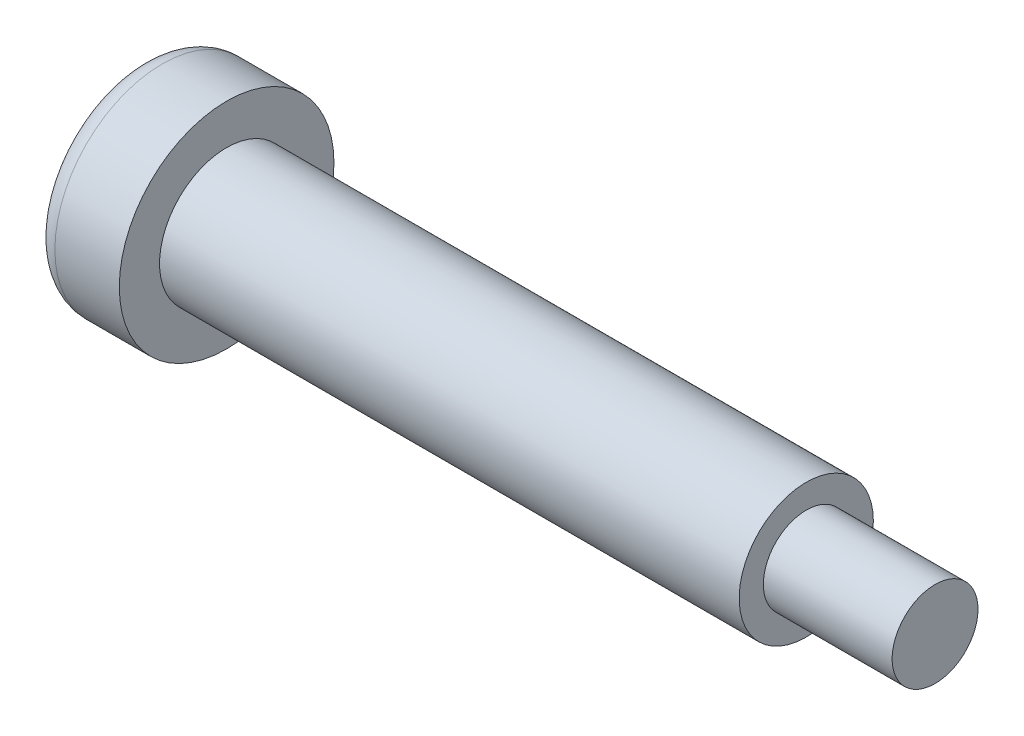
ISO-10303-21;
HEADER;
FILE_DESCRIPTION(('STEP AP214'),'2;1');
FILE_NAME('part.step','',(''),(''),'','','');
FILE_SCHEMA(('AUTOMOTIVE_DESIGN { 1 0 10303 214 1 1 1 1 }'));
ENDSEC;
DATA;
#1=APPLICATION_CONTEXT('core data for automotive mechanical design processes');
#2=APPLICATION_PROTOCOL_DEFINITION('international standard','automotive_design',2000,#1);
#3=PRODUCT_CONTEXT('',#1,'mechanical');
#4=PRODUCT('Part','Part','',(#3));
#5=PRODUCT_RELATED_PRODUCT_CATEGORY('part','',(#4));
#6=PRODUCT_DEFINITION_FORMATION('','',#4);
#7=PRODUCT_DEFINITION_CONTEXT('part definition',#1,'design');
#8=PRODUCT_DEFINITION('design','',#6,#7);
#9=PRODUCT_DEFINITION_SHAPE('','',#8);
#10=(LENGTH_UNIT() NAMED_UNIT(*) SI_UNIT(.MILLI.,.METRE.));
#11=(NAMED_UNIT(*) PLANE_ANGLE_UNIT() SI_UNIT($,.RADIAN.));
#12=(NAMED_UNIT(*) SI_UNIT($,.STERADIAN.) SOLID_ANGLE_UNIT());
#13=UNCERTAINTY_MEASURE_WITH_UNIT(LENGTH_MEASURE(1.E-05),#10,'distance_accuracy_value','');
#14=(GEOMETRIC_REPRESENTATION_CONTEXT(3) GLOBAL_UNCERTAINTY_ASSIGNED_CONTEXT((#13)) GLOBAL_UNIT_ASSIGNED_CONTEXT((#10,
#11,#12)) REPRESENTATION_CONTEXT('',''));
#15=CARTESIAN_POINT('',(0.,0.,0.));
#16=DIRECTION('',(0.,0.,1.));
#17=DIRECTION('',(1.,0.,0.));
#18=AXIS2_PLACEMENT_3D('',#15,#16,#17);
#19=CARTESIAN_POINT('',(37.,0.,0.));
#20=DIRECTION('',(-1.,0.,0.));
#21=DIRECTION('',(0.,0.,1.));
#22=AXIS2_PLACEMENT_3D('',#19,#20,#21);
#23=CYLINDRICAL_SURFACE('',#22,3.125);
#24=CARTESIAN_POINT('',(4.,0.,0.));
#25=DIRECTION('',(1.,0.,0.));
#26=DIRECTION('',(0.,0.,-1.));
#27=AXIS2_PLACEMENT_3D('',#24,#25,#26);
#28=CIRCLE('',#27,3.125);
#29=CARTESIAN_POINT('',(4.,0.,-3.125));
#30=VERTEX_POINT('',#29);
#31=EDGE_CURVE('E11',#30,#30,#28,.T.);
#32=ORIENTED_EDGE('',*,*,#31,.T.);
#33=EDGE_LOOP('',(#32));
#34=FACE_BOUND('',#33,.T.);
#35=CARTESIAN_POINT('',(31.,0.,0.));
#36=DIRECTION('',(1.,0.,0.));
#37=DIRECTION('',(0.,0.,-1.));
#38=AXIS2_PLACEMENT_3D('',#35,#36,#37);
#39=CIRCLE('',#38,3.125);
#40=CARTESIAN_POINT('',(31.,0.,-3.125));
#41=VERTEX_POINT('',#40);
#42=EDGE_CURVE('E141',#41,#41,#39,.T.);
#43=ORIENTED_EDGE('',*,*,#42,.F.);
#44=EDGE_LOOP('',(#43));
#45=FACE_BOUND('',#44,.T.);
#46=ADVANCED_FACE('F43',(#34,#45),#23,.T.);
#47=CARTESIAN_POINT('',(4.,0.,0.));
#48=DIRECTION('',(-1.,0.,0.));
#49=DIRECTION('',(0.,0.,1.));
#50=AXIS2_PLACEMENT_3D('',#47,#48,#49);
#51=CYLINDRICAL_SURFACE('',#50,5.);
#52=CARTESIAN_POINT('',(1.,0.,0.));
#53=DIRECTION('',(1.,0.,0.));
#54=DIRECTION('',(0.,0.,-1.));
#55=AXIS2_PLACEMENT_3D('',#52,#53,#54);
#56=CIRCLE('',#55,5.);
#57=CARTESIAN_POINT('',(1.,0.,-5.));
#58=VERTEX_POINT('',#57);
#59=EDGE_CURVE('E172',#58,#58,#56,.T.);
#60=ORIENTED_EDGE('',*,*,#59,.T.);
#61=EDGE_LOOP('',(#60));
#62=FACE_BOUND('',#61,.T.);
#63=CARTESIAN_POINT('',(4.,0.,0.));
#64=DIRECTION('',(1.,0.,0.));
#65=DIRECTION('',(0.,0.,-1.));
#66=AXIS2_PLACEMENT_3D('',#63,#64,#65);
#67=CIRCLE('',#66,5.);
#68=CARTESIAN_POINT('',(4.,0.,-5.));
#69=VERTEX_POINT('',#68);
#70=EDGE_CURVE('E160',#69,#69,#67,.T.);
#71=ORIENTED_EDGE('',*,*,#70,.F.);
#72=EDGE_LOOP('',(#71));
#73=FACE_BOUND('',#72,.T.);
#74=ADVANCED_FACE('F196',(#62,#73),#51,.T.);
#75=CARTESIAN_POINT('',(4.,0.,0.));
#76=DIRECTION('',(1.,0.,0.));
#77=DIRECTION('',(0.,0.,-1.));
#78=AXIS2_PLACEMENT_3D('',#75,#76,#77);
#79=PLANE('',#78);
#80=ORIENTED_EDGE('',*,*,#31,.F.);
#81=EDGE_LOOP('',(#80));
#82=FACE_BOUND('',#81,.T.);
#83=ORIENTED_EDGE('',*,*,#70,.T.);
#84=EDGE_LOOP('',(#83));
#85=FACE_BOUND('',#84,.T.);
#86=ADVANCED_FACE('F192',(#82,#85),#79,.T.);
#87=CARTESIAN_POINT('',(0.,0.,0.));
#88=DIRECTION('',(1.,0.,0.));
#89=DIRECTION('',(0.,0.,-1.));
#90=AXIS2_PLACEMENT_3D('',#87,#88,#89);
#91=PLANE('',#90);
#92=DIRECTION('',(0.,0.559454654253583,-0.828860959289315));
#93=VECTOR('',#92,1.);
#94=CARTESIAN_POINT('',(0.,1.01171932811324,2.07599550444008));
#95=LINE('',#94,#93);
#96=CARTESIAN_POINT('',(0.,1.01171932811324,2.07599550444008));
#97=VERTEX_POINT('',#96);
#98=CARTESIAN_POINT('',(0.,2.30372450904402,0.161823112574251));
#99=VERTEX_POINT('',#98);
#100=EDGE_CURVE('E140',#97,#99,#95,.T.);
#101=ORIENTED_EDGE('',*,*,#100,.F.);
#102=DIRECTION('',(0.,0.997541974076478,0.070071463204385));
#103=VECTOR('',#102,1.);
#104=CARTESIAN_POINT('',(0.,-1.29200518093078,1.91417239186583));
#105=LINE('',#104,#103);
#106=CARTESIAN_POINT('',(0.,-1.29200518093078,1.91417239186583));
#107=VERTEX_POINT('',#106);
#108=EDGE_CURVE('E60',#107,#97,#105,.T.);
#109=ORIENTED_EDGE('',*,*,#108,.F.);
#110=DIRECTION('',(0.,0.438087319822895,0.8989324224937));
#111=VECTOR('',#110,1.);
#112=CARTESIAN_POINT('',(0.,-2.30372450904402,-0.161823112574251));
#113=LINE('',#112,#111);
#114=CARTESIAN_POINT('',(0.,-2.30372450904402,-0.161823112574251));
#115=VERTEX_POINT('',#114);
#116=EDGE_CURVE('E154',#115,#107,#113,.T.);
#117=ORIENTED_EDGE('',*,*,#116,.F.);
#118=DIRECTION('',(0.,-0.559454654253583,0.828860959289315));
#119=VECTOR('',#118,1.);
#120=CARTESIAN_POINT('',(0.,-1.01171932811324,-2.07599550444008));
#121=LINE('',#120,#119);
#122=CARTESIAN_POINT('',(0.,-1.01171932811324,-2.07599550444008));
#123=VERTEX_POINT('',#122);
#124=EDGE_CURVE('E151',#123,#115,#121,.T.);
#125=ORIENTED_EDGE('',*,*,#124,.F.);
#126=DIRECTION('',(0.,-0.997541974076478,-0.0700714632043852));
#127=VECTOR('',#126,1.);
#128=CARTESIAN_POINT('',(0.,1.29200518093078,-1.91417239186583));
#129=LINE('',#128,#127);
#130=CARTESIAN_POINT('',(0.,1.29200518093078,-1.91417239186583));
#131=VERTEX_POINT('',#130);
#132=EDGE_CURVE('E108',#131,#123,#129,.T.);
#133=ORIENTED_EDGE('',*,*,#132,.F.);
#134=DIRECTION('',(0.,-0.438087319822895,-0.8989324224937));
#135=VECTOR('',#134,1.);
#136=CARTESIAN_POINT('',(0.,2.30372450904402,0.161823112574251));
#137=LINE('',#136,#135);
#138=EDGE_CURVE('E145',#99,#131,#137,.T.);
#139=ORIENTED_EDGE('',*,*,#138,.F.);
#140=EDGE_LOOP('',(#101,#109,#117,#125,#133,#139));
#141=FACE_BOUND('',#140,.T.);
#142=CARTESIAN_POINT('',(0.,0.,0.));
#143=DIRECTION('',(1.,0.,0.));
#144=DIRECTION('',(0.,0.,-1.));
#145=AXIS2_PLACEMENT_3D('',#142,#143,#144);
#146=CIRCLE('',#145,4.);
#147=CARTESIAN_POINT('',(0.,0.,-4.));
#148=VERTEX_POINT('',#147);
#149=EDGE_CURVE('E47',#148,#148,#146,.F.);
#150=ORIENTED_EDGE('',*,*,#149,.T.);
#151=EDGE_LOOP('',(#150));
#152=FACE_BOUND('',#151,.T.);
#153=ADVANCED_FACE('F181',(#141,#152),#91,.F.);
#154=CARTESIAN_POINT('',(1.,0.,0.));
#155=DIRECTION('',(1.,0.,0.));
#156=DIRECTION('',(0.,0.,-1.));
#157=AXIS2_PLACEMENT_3D('',#154,#155,#156);
#158=TOROIDAL_SURFACE('',#157,4.,1.);
#159=ORIENTED_EDGE('',*,*,#149,.F.);
#160=EDGE_LOOP('',(#159));
#161=FACE_BOUND('',#160,.T.);
#162=ORIENTED_EDGE('',*,*,#59,.F.);
#163=EDGE_LOOP('',(#162));
#164=FACE_BOUND('',#163,.T.);
#165=ADVANCED_FACE('F45',(#161,#164),#158,.T.);
#166=CARTESIAN_POINT('',(2.5,-1.29200518093078,1.91417239186583));
#167=DIRECTION('',(0.,-0.070071463204385,0.997541974076478));
#168=DIRECTION('',(0.,-0.997541974076478,-0.070071463204385));
#169=AXIS2_PLACEMENT_3D('',#166,#167,#168);
#170=PLANE('',#169);
#171=ORIENTED_EDGE('',*,*,#108,.T.);
#172=DIRECTION('',(-1.,0.,0.));
#173=VECTOR('',#172,1.);
#174=CARTESIAN_POINT('',(2.5,1.01171932811324,2.07599550444008));
#175=LINE('',#174,#173);
#176=CARTESIAN_POINT('',(2.5,1.01171932811324,2.07599550444008));
#177=VERTEX_POINT('',#176);
#178=EDGE_CURVE('E90',#177,#97,#175,.T.);
#179=ORIENTED_EDGE('',*,*,#178,.F.);
#180=DIRECTION('',(0.,0.997541974076478,0.070071463204385));
#181=VECTOR('',#180,1.);
#182=CARTESIAN_POINT('',(2.5,-1.29200518093078,1.91417239186583));
#183=LINE('',#182,#181);
#184=CARTESIAN_POINT('',(2.5,-1.29200518093078,1.91417239186583));
#185=VERTEX_POINT('',#184);
#186=EDGE_CURVE('E157',#185,#177,#183,.T.);
#187=ORIENTED_EDGE('',*,*,#186,.F.);
#188=DIRECTION('',(-1.,0.,0.));
#189=VECTOR('',#188,1.);
#190=CARTESIAN_POINT('',(2.5,-1.29200518093078,1.91417239186583));
#191=LINE('',#190,#189);
#192=EDGE_CURVE('E68',#185,#107,#191,.T.);
#193=ORIENTED_EDGE('',*,*,#192,.T.);
#194=EDGE_LOOP('',(#171,#179,#187,#193));
#195=FACE_BOUND('',#194,.T.);
#196=ADVANCED_FACE('F185',(#195),#170,.F.);
#197=CARTESIAN_POINT('',(2.5,-2.30372450904402,-0.161823112574251));
#198=DIRECTION('',(0.,-0.8989324224937,0.438087319822895));
#199=DIRECTION('',(0.,-0.438087319822895,-0.8989324224937));
#200=AXIS2_PLACEMENT_3D('',#197,#198,#199);
#201=PLANE('',#200);
#202=ORIENTED_EDGE('',*,*,#116,.T.);
#203=ORIENTED_EDGE('',*,*,#192,.F.);
#204=DIRECTION('',(0.,0.438087319822895,0.8989324224937));
#205=VECTOR('',#204,1.);
#206=CARTESIAN_POINT('',(2.5,-2.30372450904402,-0.161823112574251));
#207=LINE('',#206,#205);
#208=CARTESIAN_POINT('',(2.5,-2.30372450904402,-0.161823112574251));
#209=VERTEX_POINT('',#208);
#210=EDGE_CURVE('E122',#209,#185,#207,.T.);
#211=ORIENTED_EDGE('',*,*,#210,.F.);
#212=DIRECTION('',(-1.,0.,0.));
#213=VECTOR('',#212,1.);
#214=CARTESIAN_POINT('',(2.5,-2.30372450904402,-0.161823112574251));
#215=LINE('',#214,#213);
#216=EDGE_CURVE('E113',#209,#115,#215,.T.);
#217=ORIENTED_EDGE('',*,*,#216,.T.);
#218=EDGE_LOOP('',(#202,#203,#211,#217));
#219=FACE_BOUND('',#218,.T.);
#220=ADVANCED_FACE('F190',(#219),#201,.F.);
#221=CARTESIAN_POINT('',(2.5,-1.01171932811324,-2.07599550444008));
#222=DIRECTION('',(0.,-0.828860959289315,-0.559454654253583));
#223=DIRECTION('',(0.,0.559454654253583,-0.828860959289315));
#224=AXIS2_PLACEMENT_3D('',#221,#222,#223);
#225=PLANE('',#224);
#226=ORIENTED_EDGE('',*,*,#124,.T.);
#227=ORIENTED_EDGE('',*,*,#216,.F.);
#228=DIRECTION('',(0.,-0.559454654253583,0.828860959289315));
#229=VECTOR('',#228,1.);
#230=CARTESIAN_POINT('',(2.5,-1.01171932811324,-2.07599550444008));
#231=LINE('',#230,#229);
#232=CARTESIAN_POINT('',(2.5,-1.01171932811324,-2.07599550444008));
#233=VERTEX_POINT('',#232);
#234=EDGE_CURVE('E117',#233,#209,#231,.T.);
#235=ORIENTED_EDGE('',*,*,#234,.F.);
#236=DIRECTION('',(-1.,0.,0.));
#237=VECTOR('',#236,1.);
#238=CARTESIAN_POINT('',(2.5,-1.01171932811324,-2.07599550444008));
#239=LINE('',#238,#237);
#240=EDGE_CURVE('E101',#233,#123,#239,.T.);
#241=ORIENTED_EDGE('',*,*,#240,.T.);
#242=EDGE_LOOP('',(#226,#227,#235,#241));
#243=FACE_BOUND('',#242,.T.);
#244=ADVANCED_FACE('F118',(#243),#225,.F.);
#245=CARTESIAN_POINT('',(2.5,1.29200518093078,-1.91417239186583));
#246=DIRECTION('',(0.,0.0700714632043852,-0.997541974076478));
#247=DIRECTION('',(0.,0.997541974076478,0.0700714632043852));
#248=AXIS2_PLACEMENT_3D('',#245,#246,#247);
#249=PLANE('',#248);
#250=ORIENTED_EDGE('',*,*,#132,.T.);
#251=ORIENTED_EDGE('',*,*,#240,.F.);
#252=DIRECTION('',(0.,-0.997541974076478,-0.0700714632043852));
#253=VECTOR('',#252,1.);
#254=CARTESIAN_POINT('',(2.5,1.29200518093078,-1.91417239186583));
#255=LINE('',#254,#253);
#256=CARTESIAN_POINT('',(2.5,1.29200518093078,-1.91417239186583));
#257=VERTEX_POINT('',#256);
#258=EDGE_CURVE('E105',#257,#233,#255,.T.);
#259=ORIENTED_EDGE('',*,*,#258,.F.);
#260=DIRECTION('',(-1.,0.,0.));
#261=VECTOR('',#260,1.);
#262=CARTESIAN_POINT('',(2.5,1.29200518093078,-1.91417239186583));
#263=LINE('',#262,#261);
#264=EDGE_CURVE('E114',#257,#131,#263,.T.);
#265=ORIENTED_EDGE('',*,*,#264,.T.);
#266=EDGE_LOOP('',(#250,#251,#259,#265));
#267=FACE_BOUND('',#266,.T.);
#268=ADVANCED_FACE('F103',(#267),#249,.F.);
#269=CARTESIAN_POINT('',(2.5,2.30372450904402,0.161823112574251));
#270=DIRECTION('',(0.,0.8989324224937,-0.438087319822895));
#271=DIRECTION('',(0.,0.438087319822895,0.8989324224937));
#272=AXIS2_PLACEMENT_3D('',#269,#270,#271);
#273=PLANE('',#272);
#274=ORIENTED_EDGE('',*,*,#138,.T.);
#275=ORIENTED_EDGE('',*,*,#264,.F.);
#276=DIRECTION('',(0.,-0.438087319822895,-0.8989324224937));
#277=VECTOR('',#276,1.);
#278=CARTESIAN_POINT('',(2.5,2.30372450904402,0.161823112574251));
#279=LINE('',#278,#277);
#280=CARTESIAN_POINT('',(2.5,2.30372450904402,0.161823112574251));
#281=VERTEX_POINT('',#280);
#282=EDGE_CURVE('E128',#281,#257,#279,.T.);
#283=ORIENTED_EDGE('',*,*,#282,.F.);
#284=DIRECTION('',(-1.,0.,0.));
#285=VECTOR('',#284,1.);
#286=CARTESIAN_POINT('',(2.5,2.30372450904402,0.161823112574251));
#287=LINE('',#286,#285);
#288=EDGE_CURVE('E165',#281,#99,#287,.T.);
#289=ORIENTED_EDGE('',*,*,#288,.T.);
#290=EDGE_LOOP('',(#274,#275,#283,#289));
#291=FACE_BOUND('',#290,.T.);
#292=ADVANCED_FACE('F218',(#291),#273,.F.);
#293=CARTESIAN_POINT('',(2.5,1.01171932811324,2.07599550444008));
#294=DIRECTION('',(0.,0.828860959289315,0.559454654253583));
#295=DIRECTION('',(0.,-0.559454654253583,0.828860959289315));
#296=AXIS2_PLACEMENT_3D('',#293,#294,#295);
#297=PLANE('',#296);
#298=ORIENTED_EDGE('',*,*,#100,.T.);
#299=ORIENTED_EDGE('',*,*,#288,.F.);
#300=DIRECTION('',(0.,0.559454654253583,-0.828860959289315));
#301=VECTOR('',#300,1.);
#302=CARTESIAN_POINT('',(2.5,1.01171932811324,2.07599550444008));
#303=LINE('',#302,#301);
#304=EDGE_CURVE('E132',#177,#281,#303,.T.);
#305=ORIENTED_EDGE('',*,*,#304,.F.);
#306=ORIENTED_EDGE('',*,*,#178,.T.);
#307=EDGE_LOOP('',(#298,#299,#305,#306));
#308=FACE_BOUND('',#307,.T.);
#309=ADVANCED_FACE('F211',(#308),#297,.F.);
#310=CARTESIAN_POINT('',(2.5,0.,0.));
#311=DIRECTION('',(-1.,0.,0.));
#312=DIRECTION('',(0.,0.,1.));
#313=AXIS2_PLACEMENT_3D('',#310,#311,#312);
#314=PLANE('',#313);
#315=ORIENTED_EDGE('',*,*,#186,.T.);
#316=ORIENTED_EDGE('',*,*,#304,.T.);
#317=ORIENTED_EDGE('',*,*,#282,.T.);
#318=ORIENTED_EDGE('',*,*,#258,.T.);
#319=ORIENTED_EDGE('',*,*,#234,.T.);
#320=ORIENTED_EDGE('',*,*,#210,.T.);
#321=EDGE_LOOP('',(#315,#316,#317,#318,#319,#320));
#322=FACE_BOUND('',#321,.T.);
#323=ADVANCED_FACE('F125',(#322),#314,.T.);
#324=CARTESIAN_POINT('',(31.,0.,0.));
#325=DIRECTION('',(1.,0.,0.));
#326=DIRECTION('',(0.,0.,-1.));
#327=AXIS2_PLACEMENT_3D('',#324,#325,#326);
#328=PLANE('',#327);
#329=CARTESIAN_POINT('',(31.,0.,0.));
#330=DIRECTION('',(1.,0.,0.));
#331=DIRECTION('',(0.,0.,-1.));
#332=AXIS2_PLACEMENT_3D('',#329,#330,#331);
#333=CIRCLE('',#332,2.);
#334=CARTESIAN_POINT('',(31.,0.,-2.));
#335=VERTEX_POINT('',#334);
#336=EDGE_CURVE('E357',#335,#335,#333,.T.);
#337=ORIENTED_EDGE('',*,*,#336,.F.);
#338=EDGE_LOOP('',(#337));
#339=FACE_BOUND('',#338,.T.);
#340=ORIENTED_EDGE('',*,*,#42,.T.);
#341=EDGE_LOOP('',(#340));
#342=FACE_BOUND('',#341,.T.);
#343=ADVANCED_FACE('F210',(#339,#342),#328,.T.);
#344=CARTESIAN_POINT('',(31.,0.,0.));
#345=DIRECTION('',(1.,0.,0.));
#346=DIRECTION('',(0.,0.,-1.));
#347=AXIS2_PLACEMENT_3D('',#344,#345,#346);
#348=CYLINDRICAL_SURFACE('',#347,2.);
#349=ORIENTED_EDGE('',*,*,#336,.T.);
#350=EDGE_LOOP('',(#349));
#351=FACE_BOUND('',#350,.T.);
#352=CARTESIAN_POINT('',(37.,0.,0.));
#353=DIRECTION('',(1.,0.,0.));
#354=DIRECTION('',(0.,0.,-1.));
#355=AXIS2_PLACEMENT_3D('',#352,#353,#354);
#356=CIRCLE('',#355,2.);
#357=CARTESIAN_POINT('',(37.,0.,-2.));
#358=VERTEX_POINT('',#357);
#359=EDGE_CURVE('E354',#358,#358,#356,.T.);
#360=ORIENTED_EDGE('',*,*,#359,.F.);
#361=EDGE_LOOP('',(#360));
#362=FACE_BOUND('',#361,.T.);
#363=ADVANCED_FACE('F249',(#351,#362),#348,.T.);
#364=CARTESIAN_POINT('',(37.,0.,0.));
#365=DIRECTION('',(1.,0.,0.));
#366=DIRECTION('',(0.,0.,-1.));
#367=AXIS2_PLACEMENT_3D('',#364,#365,#366);
#368=PLANE('',#367);
#369=ORIENTED_EDGE('',*,*,#359,.T.);
#370=EDGE_LOOP('',(#369));
#371=FACE_BOUND('',#370,.T.);
#372=ADVANCED_FACE('F207',(#371),#368,.T.);
#373=CLOSED_SHELL('',(#46,#74,#86,#153,#165,#196,#220,#244,#268,#292,#309,#323,#343,#363,#372));
#374=MANIFOLD_SOLID_BREP('B2',#373);
#375=ADVANCED_BREP_SHAPE_REPRESENTATION('',(#18,#374),#14);
#376=SHAPE_DEFINITION_REPRESENTATION(#9,#375);
ENDSEC;
END-ISO-10303-21;
